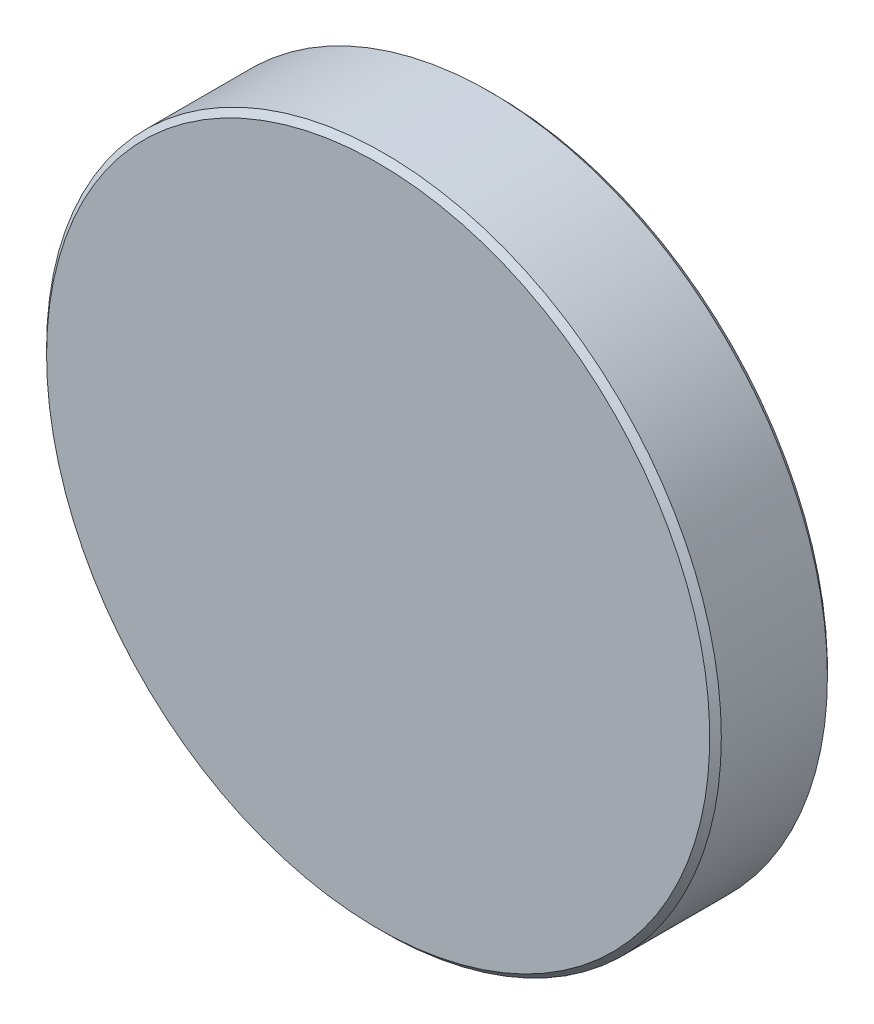
ISO-10303-21;
HEADER;
FILE_DESCRIPTION(('STEP AP214'),'2;1');
FILE_NAME('part.step','',(''),(''),'','','');
FILE_SCHEMA(('AUTOMOTIVE_DESIGN { 1 0 10303 214 1 1 1 1 }'));
ENDSEC;
DATA;
#1=APPLICATION_CONTEXT('core data for automotive mechanical design processes');
#2=APPLICATION_PROTOCOL_DEFINITION('international standard','automotive_design',2000,#1);
#3=PRODUCT_CONTEXT('',#1,'mechanical');
#4=PRODUCT('Part','Part','',(#3));
#5=PRODUCT_RELATED_PRODUCT_CATEGORY('part','',(#4));
#6=PRODUCT_DEFINITION_FORMATION('','',#4);
#7=PRODUCT_DEFINITION_CONTEXT('part definition',#1,'design');
#8=PRODUCT_DEFINITION('design','',#6,#7);
#9=PRODUCT_DEFINITION_SHAPE('','',#8);
#10=(LENGTH_UNIT() NAMED_UNIT(*) SI_UNIT(.MILLI.,.METRE.));
#11=(NAMED_UNIT(*) PLANE_ANGLE_UNIT() SI_UNIT($,.RADIAN.));
#12=(NAMED_UNIT(*) SI_UNIT($,.STERADIAN.) SOLID_ANGLE_UNIT());
#13=UNCERTAINTY_MEASURE_WITH_UNIT(LENGTH_MEASURE(1.E-05),#10,'distance_accuracy_value','');
#14=(GEOMETRIC_REPRESENTATION_CONTEXT(3) GLOBAL_UNCERTAINTY_ASSIGNED_CONTEXT((#13)) GLOBAL_UNIT_ASSIGNED_CONTEXT((#10,
#11,#12)) REPRESENTATION_CONTEXT('',''));
#15=CARTESIAN_POINT('',(0.,0.,0.));
#16=DIRECTION('',(0.,0.,1.));
#17=DIRECTION('',(1.,0.,0.));
#18=AXIS2_PLACEMENT_3D('',#15,#16,#17);
#19=CARTESIAN_POINT('',(0.,0.,0.136462882096069));
#20=DIRECTION('',(0.,0.,-1.));
#21=DIRECTION('',(-1.,0.,0.));
#22=AXIS2_PLACEMENT_3D('',#19,#20,#21);
#23=CONICAL_SURFACE('',#22,6.35917030567686,0.785398163397457);
#24=CARTESIAN_POINT('',(0.,0.,0.245633187772923));
#25=DIRECTION('',(0.,0.,-1.));
#26=DIRECTION('',(-1.,0.,0.));
#27=AXIS2_PLACEMENT_3D('',#24,#25,#26);
#28=CIRCLE('',#27,6.25);
#29=CARTESIAN_POINT('',(-6.25,0.,0.24563318777292));
#30=VERTEX_POINT('',#29);
#31=EDGE_CURVE('E46',#30,#30,#28,.T.);
#32=ORIENTED_EDGE('',*,*,#31,.T.);
#33=EDGE_LOOP('',(#32));
#34=FACE_BOUND('',#33,.T.);
#35=CARTESIAN_POINT('',(0.,0.,0.136462882096069));
#36=DIRECTION('',(0.,0.,-1.));
#37=DIRECTION('',(-1.,0.,0.));
#38=AXIS2_PLACEMENT_3D('',#35,#36,#37);
#39=CIRCLE('',#38,6.35917030567686);
#40=CARTESIAN_POINT('',(-6.35917030567686,0.,0.136462882096066));
#41=VERTEX_POINT('',#40);
#42=EDGE_CURVE('E10',#41,#41,#39,.T.);
#43=ORIENTED_EDGE('',*,*,#42,.F.);
#44=EDGE_LOOP('',(#43));
#45=FACE_BOUND('',#44,.T.);
#46=ADVANCED_FACE('F32',(#34,#45),#23,.T.);
#47=CARTESIAN_POINT('',(0.,0.,0.245633187772925));
#48=DIRECTION('',(0.,0.,-1.));
#49=DIRECTION('',(-1.,0.,0.));
#50=AXIS2_PLACEMENT_3D('',#47,#48,#49);
#51=CYLINDRICAL_SURFACE('',#50,6.35917030567686);
#52=ORIENTED_EDGE('',*,*,#42,.T.);
#53=EDGE_LOOP('',(#52));
#54=FACE_BOUND('',#53,.T.);
#55=CARTESIAN_POINT('',(0.,0.,-1.86353711790393));
#56=DIRECTION('',(0.,0.,-1.));
#57=DIRECTION('',(-1.,0.,0.));
#58=AXIS2_PLACEMENT_3D('',#55,#56,#57);
#59=CIRCLE('',#58,6.35917030567686);
#60=CARTESIAN_POINT('',(-6.35917030567686,0.,-1.86353711790393));
#61=VERTEX_POINT('',#60);
#62=EDGE_CURVE('E38',#61,#61,#59,.T.);
#63=ORIENTED_EDGE('',*,*,#62,.F.);
#64=EDGE_LOOP('',(#63));
#65=FACE_BOUND('',#64,.T.);
#66=ADVANCED_FACE('F65',(#54,#65),#51,.T.);
#67=CARTESIAN_POINT('',(0.,0.,-1.97270742358079));
#68=DIRECTION('',(0.,0.,1.));
#69=DIRECTION('',(1.,0.,0.));
#70=AXIS2_PLACEMENT_3D('',#67,#68,#69);
#71=CONICAL_SURFACE('',#70,6.25,0.785398163397452);
#72=ORIENTED_EDGE('',*,*,#62,.T.);
#73=EDGE_LOOP('',(#72));
#74=FACE_BOUND('',#73,.T.);
#75=CARTESIAN_POINT('',(0.,0.,-1.97270742358079));
#76=DIRECTION('',(0.,0.,-1.));
#77=DIRECTION('',(-1.,0.,0.));
#78=AXIS2_PLACEMENT_3D('',#75,#76,#77);
#79=CIRCLE('',#78,6.25);
#80=CARTESIAN_POINT('',(-6.25,0.,-1.97270742358079));
#81=VERTEX_POINT('',#80);
#82=EDGE_CURVE('E42',#81,#81,#79,.T.);
#83=ORIENTED_EDGE('',*,*,#82,.F.);
#84=EDGE_LOOP('',(#83));
#85=FACE_BOUND('',#84,.T.);
#86=ADVANCED_FACE('F61',(#74,#85),#71,.T.);
#87=CARTESIAN_POINT('',(0.,0.,-1.97270742358078));
#88=DIRECTION('',(0.,0.,-1.));
#89=DIRECTION('',(-1.,0.,0.));
#90=AXIS2_PLACEMENT_3D('',#87,#88,#89);
#91=PLANE('',#90);
#92=ORIENTED_EDGE('',*,*,#82,.T.);
#93=EDGE_LOOP('',(#92));
#94=FACE_BOUND('',#93,.T.);
#95=ADVANCED_FACE('F56',(#94),#91,.T.);
#96=CARTESIAN_POINT('',(6.25,0.,0.245633187772926));
#97=DIRECTION('',(0.,0.,1.));
#98=DIRECTION('',(1.,0.,0.));
#99=AXIS2_PLACEMENT_3D('',#96,#97,#98);
#100=PLANE('',#99);
#101=ORIENTED_EDGE('',*,*,#31,.F.);
#102=EDGE_LOOP('',(#101));
#103=FACE_BOUND('',#102,.T.);
#104=ADVANCED_FACE('F54',(#103),#100,.T.);
#105=CLOSED_SHELL('',(#46,#66,#86,#95,#104));
#106=MANIFOLD_SOLID_BREP('B2',#105);
#107=ADVANCED_BREP_SHAPE_REPRESENTATION('',(#18,#106),#14);
#108=SHAPE_DEFINITION_REPRESENTATION(#9,#107);
ENDSEC;
END-ISO-10303-21;
